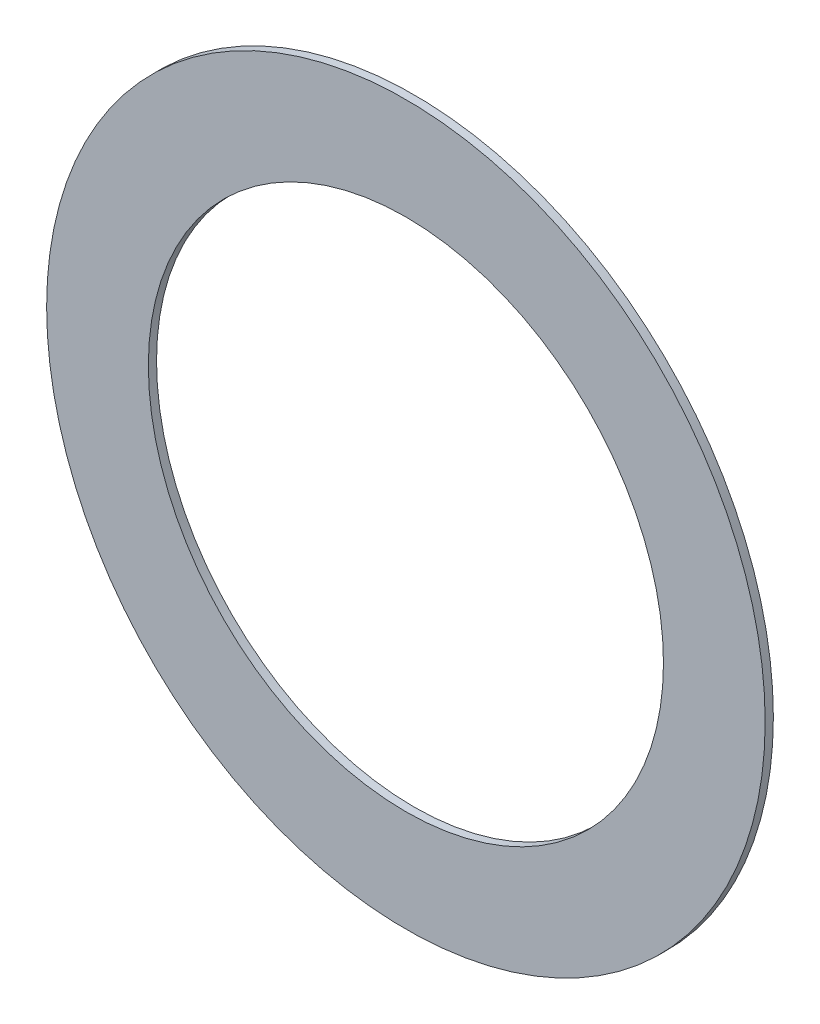
ISO-10303-21;
HEADER;
FILE_DESCRIPTION(('STEP AP214'),'2;1');
FILE_NAME('part.step','',(''),(''),'','','');
FILE_SCHEMA(('AUTOMOTIVE_DESIGN { 1 0 10303 214 1 1 1 1 }'));
ENDSEC;
DATA;
#1=APPLICATION_CONTEXT('core data for automotive mechanical design processes');
#2=APPLICATION_PROTOCOL_DEFINITION('international standard','automotive_design',2000,#1);
#3=PRODUCT_CONTEXT('',#1,'mechanical');
#4=PRODUCT('Part','Part','',(#3));
#5=PRODUCT_RELATED_PRODUCT_CATEGORY('part','',(#4));
#6=PRODUCT_DEFINITION_FORMATION('','',#4);
#7=PRODUCT_DEFINITION_CONTEXT('part definition',#1,'design');
#8=PRODUCT_DEFINITION('design','',#6,#7);
#9=PRODUCT_DEFINITION_SHAPE('','',#8);
#10=(LENGTH_UNIT() NAMED_UNIT(*) SI_UNIT(.MILLI.,.METRE.));
#11=(NAMED_UNIT(*) PLANE_ANGLE_UNIT() SI_UNIT($,.RADIAN.));
#12=(NAMED_UNIT(*) SI_UNIT($,.STERADIAN.) SOLID_ANGLE_UNIT());
#13=UNCERTAINTY_MEASURE_WITH_UNIT(LENGTH_MEASURE(1.E-05),#10,'distance_accuracy_value','');
#14=(GEOMETRIC_REPRESENTATION_CONTEXT(3) GLOBAL_UNCERTAINTY_ASSIGNED_CONTEXT((#13)) GLOBAL_UNIT_ASSIGNED_CONTEXT((#10,
#11,#12)) REPRESENTATION_CONTEXT('',''));
#15=CARTESIAN_POINT('',(0.,0.,0.));
#16=DIRECTION('',(0.,0.,1.));
#17=DIRECTION('',(1.,0.,0.));
#18=AXIS2_PLACEMENT_3D('',#15,#16,#17);
#19=CARTESIAN_POINT('',(0.,0.,0.127));
#20=DIRECTION('',(0.,0.,1.));
#21=DIRECTION('',(1.,0.,0.));
#22=AXIS2_PLACEMENT_3D('',#19,#20,#21);
#23=PLANE('',#22);
#24=CARTESIAN_POINT('',(0.,0.,0.127));
#25=DIRECTION('',(0.,0.,1.));
#26=DIRECTION('',(1.,0.,0.));
#27=AXIS2_PLACEMENT_3D('',#24,#25,#26);
#28=CIRCLE('',#27,5.5626);
#29=CARTESIAN_POINT('',(5.5626,0.,0.127));
#30=VERTEX_POINT('',#29);
#31=EDGE_CURVE('E10',#30,#30,#28,.T.);
#32=ORIENTED_EDGE('',*,*,#31,.T.);
#33=EDGE_LOOP('',(#32));
#34=FACE_BOUND('',#33,.T.);
#35=CARTESIAN_POINT('',(0.,0.,0.127));
#36=DIRECTION('',(0.,0.,1.));
#37=DIRECTION('',(1.,0.,0.));
#38=AXIS2_PLACEMENT_3D('',#35,#36,#37);
#39=CIRCLE('',#38,3.9878);
#40=CARTESIAN_POINT('',(3.9878,0.,0.127));
#41=VERTEX_POINT('',#40);
#42=EDGE_CURVE('E42',#41,#41,#39,.T.);
#43=ORIENTED_EDGE('',*,*,#42,.F.);
#44=EDGE_LOOP('',(#43));
#45=FACE_BOUND('',#44,.T.);
#46=ADVANCED_FACE('F31',(#34,#45),#23,.T.);
#47=CARTESIAN_POINT('',(0.,0.,0.));
#48=DIRECTION('',(0.,0.,1.));
#49=DIRECTION('',(1.,0.,0.));
#50=AXIS2_PLACEMENT_3D('',#47,#48,#49);
#51=PLANE('',#50);
#52=CARTESIAN_POINT('',(0.,0.,0.));
#53=DIRECTION('',(0.,0.,1.));
#54=DIRECTION('',(1.,0.,0.));
#55=AXIS2_PLACEMENT_3D('',#52,#53,#54);
#56=CIRCLE('',#55,5.5626);
#57=CARTESIAN_POINT('',(5.5626,0.,0.));
#58=VERTEX_POINT('',#57);
#59=EDGE_CURVE('E35',#58,#58,#56,.T.);
#60=ORIENTED_EDGE('',*,*,#59,.F.);
#61=EDGE_LOOP('',(#60));
#62=FACE_BOUND('',#61,.T.);
#63=CARTESIAN_POINT('',(0.,0.,0.));
#64=DIRECTION('',(0.,0.,1.));
#65=DIRECTION('',(1.,0.,0.));
#66=AXIS2_PLACEMENT_3D('',#63,#64,#65);
#67=CIRCLE('',#66,3.9878);
#68=CARTESIAN_POINT('',(3.9878,0.,0.));
#69=VERTEX_POINT('',#68);
#70=EDGE_CURVE('E44',#69,#69,#67,.T.);
#71=ORIENTED_EDGE('',*,*,#70,.T.);
#72=EDGE_LOOP('',(#71));
#73=FACE_BOUND('',#72,.T.);
#74=ADVANCED_FACE('F54',(#62,#73),#51,.F.);
#75=CARTESIAN_POINT('',(0.,0.,0.127));
#76=DIRECTION('',(0.,0.,-1.));
#77=DIRECTION('',(-1.,0.,0.));
#78=AXIS2_PLACEMENT_3D('',#75,#76,#77);
#79=CYLINDRICAL_SURFACE('',#78,5.5626);
#80=ORIENTED_EDGE('',*,*,#31,.F.);
#81=EDGE_LOOP('',(#80));
#82=FACE_BOUND('',#81,.T.);
#83=ORIENTED_EDGE('',*,*,#59,.T.);
#84=EDGE_LOOP('',(#83));
#85=FACE_BOUND('',#84,.T.);
#86=ADVANCED_FACE('F33',(#82,#85),#79,.T.);
#87=CARTESIAN_POINT('',(0.,0.,0.127));
#88=DIRECTION('',(0.,0.,-1.));
#89=DIRECTION('',(-1.,0.,0.));
#90=AXIS2_PLACEMENT_3D('',#87,#88,#89);
#91=CYLINDRICAL_SURFACE('',#90,3.9878);
#92=ORIENTED_EDGE('',*,*,#42,.T.);
#93=EDGE_LOOP('',(#92));
#94=FACE_BOUND('',#93,.T.);
#95=ORIENTED_EDGE('',*,*,#70,.F.);
#96=EDGE_LOOP('',(#95));
#97=FACE_BOUND('',#96,.T.);
#98=ADVANCED_FACE('F50',(#94,#97),#91,.F.);
#99=CLOSED_SHELL('',(#46,#74,#86,#98));
#100=MANIFOLD_SOLID_BREP('B2',#99);
#101=ADVANCED_BREP_SHAPE_REPRESENTATION('',(#18,#100),#14);
#102=SHAPE_DEFINITION_REPRESENTATION(#9,#101);
ENDSEC;
END-ISO-10303-21;
